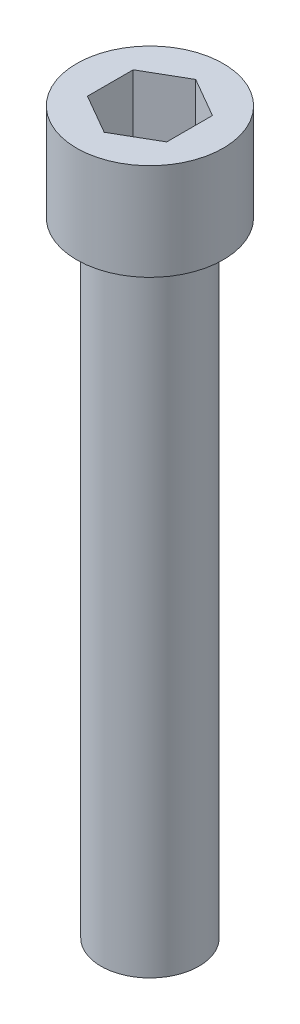
ISO-10303-21;
HEADER;
FILE_DESCRIPTION(('STEP AP214'),'2;1');
FILE_NAME('part.step','',(''),(''),'','','');
FILE_SCHEMA(('AUTOMOTIVE_DESIGN { 1 0 10303 214 1 1 1 1 }'));
ENDSEC;
DATA;
#1=APPLICATION_CONTEXT('core data for automotive mechanical design processes');
#2=APPLICATION_PROTOCOL_DEFINITION('international standard','automotive_design',2000,#1);
#3=PRODUCT_CONTEXT('',#1,'mechanical');
#4=PRODUCT('Part','Part','',(#3));
#5=PRODUCT_RELATED_PRODUCT_CATEGORY('part','',(#4));
#6=PRODUCT_DEFINITION_FORMATION('','',#4);
#7=PRODUCT_DEFINITION_CONTEXT('part definition',#1,'design');
#8=PRODUCT_DEFINITION('design','',#6,#7);
#9=PRODUCT_DEFINITION_SHAPE('','',#8);
#10=(LENGTH_UNIT() NAMED_UNIT(*) SI_UNIT(.MILLI.,.METRE.));
#11=(NAMED_UNIT(*) PLANE_ANGLE_UNIT() SI_UNIT($,.RADIAN.));
#12=(NAMED_UNIT(*) SI_UNIT($,.STERADIAN.) SOLID_ANGLE_UNIT());
#13=UNCERTAINTY_MEASURE_WITH_UNIT(LENGTH_MEASURE(1.E-05),#10,'distance_accuracy_value','');
#14=(GEOMETRIC_REPRESENTATION_CONTEXT(3) GLOBAL_UNCERTAINTY_ASSIGNED_CONTEXT((#13)) GLOBAL_UNIT_ASSIGNED_CONTEXT((#10,
#11,#12)) REPRESENTATION_CONTEXT('',''));
#15=CARTESIAN_POINT('',(0.,0.,0.));
#16=DIRECTION('',(0.,0.,1.));
#17=DIRECTION('',(1.,0.,0.));
#18=AXIS2_PLACEMENT_3D('',#15,#16,#17);
#19=CARTESIAN_POINT('',(0.,7.75,0.));
#20=DIRECTION('',(0.,-1.,0.));
#21=DIRECTION('',(0.,0.,-1.));
#22=AXIS2_PLACEMENT_3D('',#19,#20,#21);
#23=CYLINDRICAL_SURFACE('',#22,5.875);
#24=CARTESIAN_POINT('',(0.,7.75,0.));
#25=DIRECTION('',(0.,1.,0.));
#26=DIRECTION('',(0.,0.,1.));
#27=AXIS2_PLACEMENT_3D('',#24,#25,#26);
#28=CIRCLE('',#27,5.875);
#29=CARTESIAN_POINT('',(0.,7.75,5.875));
#30=VERTEX_POINT('',#29);
#31=EDGE_CURVE('E40',#30,#30,#28,.T.);
#32=ORIENTED_EDGE('',*,*,#31,.F.);
#33=EDGE_LOOP('',(#32));
#34=FACE_BOUND('',#33,.T.);
#35=CARTESIAN_POINT('',(0.,0.,0.));
#36=DIRECTION('',(0.,1.,0.));
#37=DIRECTION('',(0.,0.,1.));
#38=AXIS2_PLACEMENT_3D('',#35,#36,#37);
#39=CIRCLE('',#38,5.875);
#40=CARTESIAN_POINT('',(0.,0.,5.875));
#41=VERTEX_POINT('',#40);
#42=EDGE_CURVE('E35',#41,#41,#39,.T.);
#43=ORIENTED_EDGE('',*,*,#42,.T.);
#44=EDGE_LOOP('',(#43));
#45=FACE_BOUND('',#44,.T.);
#46=ADVANCED_FACE('F32',(#34,#45),#23,.T.);
#47=CARTESIAN_POINT('',(0.,7.75,0.));
#48=DIRECTION('',(0.,1.,0.));
#49=DIRECTION('',(0.,0.,1.));
#50=AXIS2_PLACEMENT_3D('',#47,#48,#49);
#51=PLANE('',#50);
#52=DIRECTION('',(-0.866025403784439,0.,-0.5));
#53=VECTOR('',#52,1.);
#54=CARTESIAN_POINT('',(3.175,7.75,-1.83308710467706));
#55=LINE('',#54,#53);
#56=CARTESIAN_POINT('',(3.175,7.75,-1.83308710467706));
#57=VERTEX_POINT('',#56);
#58=CARTESIAN_POINT('',(0.,7.75,-3.66617420935412));
#59=VERTEX_POINT('',#58);
#60=EDGE_CURVE('E48',#57,#59,#55,.T.);
#61=ORIENTED_EDGE('',*,*,#60,.F.);
#62=DIRECTION('',(0.,0.,-1.));
#63=VECTOR('',#62,1.);
#64=CARTESIAN_POINT('',(3.175,7.75,1.83308710467706));
#65=LINE('',#64,#63);
#66=CARTESIAN_POINT('',(3.175,7.75,1.83308710467706));
#67=VERTEX_POINT('',#66);
#68=EDGE_CURVE('E132',#67,#57,#65,.T.);
#69=ORIENTED_EDGE('',*,*,#68,.F.);
#70=DIRECTION('',(0.866025403784439,0.,-0.5));
#71=VECTOR('',#70,1.);
#72=CARTESIAN_POINT('',(0.,7.75,3.66617420935412));
#73=LINE('',#72,#71);
#74=CARTESIAN_POINT('',(0.,7.75,3.66617420935412));
#75=VERTEX_POINT('',#74);
#76=EDGE_CURVE('E130',#75,#67,#73,.T.);
#77=ORIENTED_EDGE('',*,*,#76,.F.);
#78=DIRECTION('',(0.866025403784439,0.,0.5));
#79=VECTOR('',#78,1.);
#80=CARTESIAN_POINT('',(-3.175,7.75,1.83308710467706));
#81=LINE('',#80,#79);
#82=CARTESIAN_POINT('',(-3.175,7.75,1.83308710467706));
#83=VERTEX_POINT('',#82);
#84=EDGE_CURVE('E96',#83,#75,#81,.T.);
#85=ORIENTED_EDGE('',*,*,#84,.F.);
#86=DIRECTION('',(0.,0.,1.));
#87=VECTOR('',#86,1.);
#88=CARTESIAN_POINT('',(-3.175,7.75,-1.83308710467706));
#89=LINE('',#88,#87);
#90=CARTESIAN_POINT('',(-3.175,7.75,-1.83308710467706));
#91=VERTEX_POINT('',#90);
#92=EDGE_CURVE('E126',#91,#83,#89,.T.);
#93=ORIENTED_EDGE('',*,*,#92,.F.);
#94=DIRECTION('',(-0.866025403784439,0.,0.5));
#95=VECTOR('',#94,1.);
#96=CARTESIAN_POINT('',(0.,7.75,-3.66617420935412));
#97=LINE('',#96,#95);
#98=EDGE_CURVE('E122',#59,#91,#97,.T.);
#99=ORIENTED_EDGE('',*,*,#98,.F.);
#100=EDGE_LOOP('',(#61,#69,#77,#85,#93,#99));
#101=FACE_BOUND('',#100,.T.);
#102=ORIENTED_EDGE('',*,*,#31,.T.);
#103=EDGE_LOOP('',(#102));
#104=FACE_BOUND('',#103,.T.);
#105=ADVANCED_FACE('F150',(#101,#104),#51,.T.);
#106=CARTESIAN_POINT('',(0.,0.,0.));
#107=DIRECTION('',(0.,1.,0.));
#108=DIRECTION('',(0.,0.,1.));
#109=AXIS2_PLACEMENT_3D('',#106,#107,#108);
#110=PLANE('',#109);
#111=CARTESIAN_POINT('',(0.,0.,0.));
#112=DIRECTION('',(0.,-1.,0.));
#113=DIRECTION('',(0.,0.,-1.));
#114=AXIS2_PLACEMENT_3D('',#111,#112,#113);
#115=CIRCLE('',#114,3.925);
#116=CARTESIAN_POINT('',(0.,0.,-3.925));
#117=VERTEX_POINT('',#116);
#118=EDGE_CURVE('E11',#117,#117,#115,.T.);
#119=ORIENTED_EDGE('',*,*,#118,.F.);
#120=EDGE_LOOP('',(#119));
#121=FACE_BOUND('',#120,.T.);
#122=ORIENTED_EDGE('',*,*,#42,.F.);
#123=EDGE_LOOP('',(#122));
#124=FACE_BOUND('',#123,.T.);
#125=ADVANCED_FACE('F147',(#121,#124),#110,.F.);
#126=CARTESIAN_POINT('',(3.175,2.25,-1.83308710467706));
#127=DIRECTION('',(0.5,0.,-0.866025403784439));
#128=DIRECTION('',(-0.866025403784439,0.,-0.5));
#129=AXIS2_PLACEMENT_3D('',#126,#127,#128);
#130=PLANE('',#129);
#131=ORIENTED_EDGE('',*,*,#60,.T.);
#132=DIRECTION('',(0.,1.,0.));
#133=VECTOR('',#132,1.);
#134=CARTESIAN_POINT('',(0.,2.25,-3.66617420935412));
#135=LINE('',#134,#133);
#136=CARTESIAN_POINT('',(0.,2.25,-3.66617420935412));
#137=VERTEX_POINT('',#136);
#138=EDGE_CURVE('E78',#137,#59,#135,.T.);
#139=ORIENTED_EDGE('',*,*,#138,.F.);
#140=DIRECTION('',(-0.866025403784439,0.,-0.5));
#141=VECTOR('',#140,1.);
#142=CARTESIAN_POINT('',(3.175,2.25,-1.83308710467706));
#143=LINE('',#142,#141);
#144=CARTESIAN_POINT('',(3.175,2.25,-1.83308710467706));
#145=VERTEX_POINT('',#144);
#146=EDGE_CURVE('E134',#145,#137,#143,.T.);
#147=ORIENTED_EDGE('',*,*,#146,.F.);
#148=DIRECTION('',(0.,1.,0.));
#149=VECTOR('',#148,1.);
#150=CARTESIAN_POINT('',(3.175,2.25,-1.83308710467706));
#151=LINE('',#150,#149);
#152=EDGE_CURVE('E56',#145,#57,#151,.T.);
#153=ORIENTED_EDGE('',*,*,#152,.T.);
#154=EDGE_LOOP('',(#131,#139,#147,#153));
#155=FACE_BOUND('',#154,.T.);
#156=ADVANCED_FACE('F149',(#155),#130,.F.);
#157=CARTESIAN_POINT('',(3.175,2.25,1.83308710467706));
#158=DIRECTION('',(1.,0.,0.));
#159=DIRECTION('',(0.,0.,-1.));
#160=AXIS2_PLACEMENT_3D('',#157,#158,#159);
#161=PLANE('',#160);
#162=ORIENTED_EDGE('',*,*,#68,.T.);
#163=ORIENTED_EDGE('',*,*,#152,.F.);
#164=DIRECTION('',(0.,0.,-1.));
#165=VECTOR('',#164,1.);
#166=CARTESIAN_POINT('',(3.175,2.25,1.83308710467706));
#167=LINE('',#166,#165);
#168=CARTESIAN_POINT('',(3.175,2.25,1.83308710467706));
#169=VERTEX_POINT('',#168);
#170=EDGE_CURVE('E108',#169,#145,#167,.T.);
#171=ORIENTED_EDGE('',*,*,#170,.F.);
#172=DIRECTION('',(0.,1.,0.));
#173=VECTOR('',#172,1.);
#174=CARTESIAN_POINT('',(3.175,2.25,1.83308710467706));
#175=LINE('',#174,#173);
#176=EDGE_CURVE('E100',#169,#67,#175,.T.);
#177=ORIENTED_EDGE('',*,*,#176,.T.);
#178=EDGE_LOOP('',(#162,#163,#171,#177));
#179=FACE_BOUND('',#178,.T.);
#180=ADVANCED_FACE('F156',(#179),#161,.F.);
#181=CARTESIAN_POINT('',(0.,2.25,3.66617420935412));
#182=DIRECTION('',(0.5,0.,0.866025403784439));
#183=DIRECTION('',(0.866025403784439,0.,-0.5));
#184=AXIS2_PLACEMENT_3D('',#181,#182,#183);
#185=PLANE('',#184);
#186=ORIENTED_EDGE('',*,*,#76,.T.);
#187=ORIENTED_EDGE('',*,*,#176,.F.);
#188=DIRECTION('',(0.866025403784439,0.,-0.5));
#189=VECTOR('',#188,1.);
#190=CARTESIAN_POINT('',(0.,2.25,3.66617420935412));
#191=LINE('',#190,#189);
#192=CARTESIAN_POINT('',(0.,2.25,3.66617420935412));
#193=VERTEX_POINT('',#192);
#194=EDGE_CURVE('E104',#193,#169,#191,.T.);
#195=ORIENTED_EDGE('',*,*,#194,.F.);
#196=DIRECTION('',(0.,1.,0.));
#197=VECTOR('',#196,1.);
#198=CARTESIAN_POINT('',(0.,2.25,3.66617420935412));
#199=LINE('',#198,#197);
#200=EDGE_CURVE('E89',#193,#75,#199,.T.);
#201=ORIENTED_EDGE('',*,*,#200,.T.);
#202=EDGE_LOOP('',(#186,#187,#195,#201));
#203=FACE_BOUND('',#202,.T.);
#204=ADVANCED_FACE('F105',(#203),#185,.F.);
#205=CARTESIAN_POINT('',(-3.175,2.25,1.83308710467706));
#206=DIRECTION('',(-0.5,0.,0.866025403784439));
#207=DIRECTION('',(0.866025403784439,0.,0.5));
#208=AXIS2_PLACEMENT_3D('',#205,#206,#207);
#209=PLANE('',#208);
#210=ORIENTED_EDGE('',*,*,#84,.T.);
#211=ORIENTED_EDGE('',*,*,#200,.F.);
#212=DIRECTION('',(0.866025403784439,0.,0.5));
#213=VECTOR('',#212,1.);
#214=CARTESIAN_POINT('',(-3.175,2.25,1.83308710467706));
#215=LINE('',#214,#213);
#216=CARTESIAN_POINT('',(-3.175,2.25,1.83308710467706));
#217=VERTEX_POINT('',#216);
#218=EDGE_CURVE('E93',#217,#193,#215,.T.);
#219=ORIENTED_EDGE('',*,*,#218,.F.);
#220=DIRECTION('',(0.,1.,0.));
#221=VECTOR('',#220,1.);
#222=CARTESIAN_POINT('',(-3.175,2.25,1.83308710467706));
#223=LINE('',#222,#221);
#224=EDGE_CURVE('E101',#217,#83,#223,.T.);
#225=ORIENTED_EDGE('',*,*,#224,.T.);
#226=EDGE_LOOP('',(#210,#211,#219,#225));
#227=FACE_BOUND('',#226,.T.);
#228=ADVANCED_FACE('F91',(#227),#209,.F.);
#229=CARTESIAN_POINT('',(-3.175,2.25,-1.83308710467706));
#230=DIRECTION('',(-1.,0.,0.));
#231=DIRECTION('',(0.,0.,1.));
#232=AXIS2_PLACEMENT_3D('',#229,#230,#231);
#233=PLANE('',#232);
#234=ORIENTED_EDGE('',*,*,#92,.T.);
#235=ORIENTED_EDGE('',*,*,#224,.F.);
#236=DIRECTION('',(0.,0.,1.));
#237=VECTOR('',#236,1.);
#238=CARTESIAN_POINT('',(-3.175,2.25,-1.83308710467706));
#239=LINE('',#238,#237);
#240=CARTESIAN_POINT('',(-3.175,2.25,-1.83308710467706));
#241=VERTEX_POINT('',#240);
#242=EDGE_CURVE('E114',#241,#217,#239,.T.);
#243=ORIENTED_EDGE('',*,*,#242,.F.);
#244=DIRECTION('',(0.,1.,0.));
#245=VECTOR('',#244,1.);
#246=CARTESIAN_POINT('',(-3.175,2.25,-1.83308710467706));
#247=LINE('',#246,#245);
#248=EDGE_CURVE('E138',#241,#91,#247,.T.);
#249=ORIENTED_EDGE('',*,*,#248,.T.);
#250=EDGE_LOOP('',(#234,#235,#243,#249));
#251=FACE_BOUND('',#250,.T.);
#252=ADVANCED_FACE('F201',(#251),#233,.F.);
#253=CARTESIAN_POINT('',(0.,2.25,-3.66617420935412));
#254=DIRECTION('',(-0.5,0.,-0.866025403784439));
#255=DIRECTION('',(-0.866025403784439,0.,0.5));
#256=AXIS2_PLACEMENT_3D('',#253,#254,#255);
#257=PLANE('',#256);
#258=ORIENTED_EDGE('',*,*,#98,.T.);
#259=ORIENTED_EDGE('',*,*,#248,.F.);
#260=DIRECTION('',(-0.866025403784439,0.,0.5));
#261=VECTOR('',#260,1.);
#262=CARTESIAN_POINT('',(0.,2.25,-3.66617420935412));
#263=LINE('',#262,#261);
#264=EDGE_CURVE('E116',#137,#241,#263,.T.);
#265=ORIENTED_EDGE('',*,*,#264,.F.);
#266=ORIENTED_EDGE('',*,*,#138,.T.);
#267=EDGE_LOOP('',(#258,#259,#265,#266));
#268=FACE_BOUND('',#267,.T.);
#269=ADVANCED_FACE('F210',(#268),#257,.F.);
#270=CARTESIAN_POINT('',(0.,2.25,0.));
#271=DIRECTION('',(0.,1.,0.));
#272=DIRECTION('',(0.,0.,1.));
#273=AXIS2_PLACEMENT_3D('',#270,#271,#272);
#274=PLANE('',#273);
#275=ORIENTED_EDGE('',*,*,#146,.T.);
#276=ORIENTED_EDGE('',*,*,#264,.T.);
#277=ORIENTED_EDGE('',*,*,#242,.T.);
#278=ORIENTED_EDGE('',*,*,#218,.T.);
#279=ORIENTED_EDGE('',*,*,#194,.T.);
#280=ORIENTED_EDGE('',*,*,#170,.T.);
#281=EDGE_LOOP('',(#275,#276,#277,#278,#279,#280));
#282=FACE_BOUND('',#281,.T.);
#283=ADVANCED_FACE('F111',(#282),#274,.T.);
#284=CARTESIAN_POINT('',(0.,-10.,0.));
#285=DIRECTION('',(0.,1.,0.));
#286=DIRECTION('',(0.,0.,1.));
#287=AXIS2_PLACEMENT_3D('',#284,#285,#286);
#288=CYLINDRICAL_SURFACE('',#287,3.925);
#289=ORIENTED_EDGE('',*,*,#118,.T.);
#290=EDGE_LOOP('',(#289));
#291=FACE_BOUND('',#290,.T.);
#292=CARTESIAN_POINT('',(0.,-50.,0.));
#293=DIRECTION('',(0.,-1.,0.));
#294=DIRECTION('',(0.,0.,-1.));
#295=AXIS2_PLACEMENT_3D('',#292,#293,#294);
#296=CIRCLE('',#295,3.925);
#297=CARTESIAN_POINT('',(0.,-50.,-3.925));
#298=VERTEX_POINT('',#297);
#299=EDGE_CURVE('E123',#298,#298,#296,.T.);
#300=ORIENTED_EDGE('',*,*,#299,.F.);
#301=EDGE_LOOP('',(#300));
#302=FACE_BOUND('',#301,.T.);
#303=ADVANCED_FACE('F228',(#291,#302),#288,.T.);
#304=CARTESIAN_POINT('',(0.,-50.,0.));
#305=DIRECTION('',(0.,-1.,0.));
#306=DIRECTION('',(0.,0.,-1.));
#307=AXIS2_PLACEMENT_3D('',#304,#305,#306);
#308=PLANE('',#307);
#309=ORIENTED_EDGE('',*,*,#299,.T.);
#310=EDGE_LOOP('',(#309));
#311=FACE_BOUND('',#310,.T.);
#312=ADVANCED_FACE('F242',(#311),#308,.T.);
#313=CLOSED_SHELL('',(#46,#105,#125,#156,#180,#204,#228,#252,#269,#283,#303,#312));
#314=MANIFOLD_SOLID_BREP('B2',#313);
#315=ADVANCED_BREP_SHAPE_REPRESENTATION('',(#18,#314),#14);
#316=SHAPE_DEFINITION_REPRESENTATION(#9,#315);
ENDSEC;
END-ISO-10303-21;
